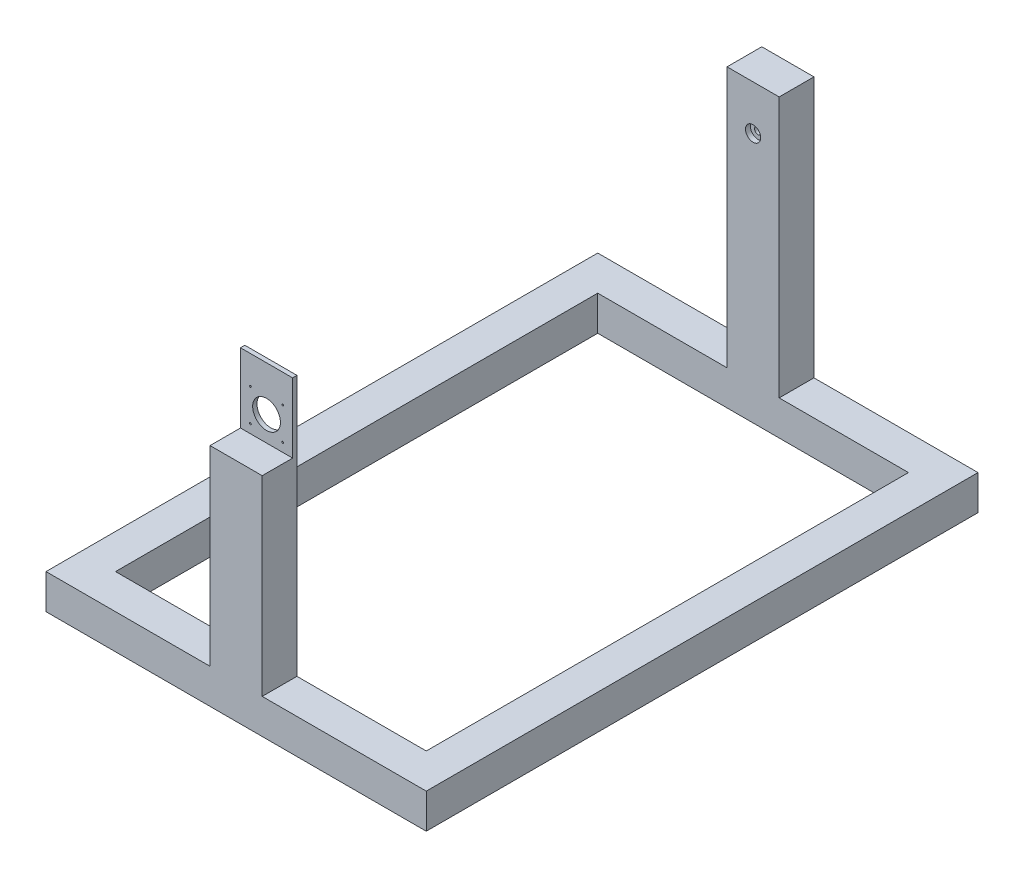
ISO-10303-21;
HEADER;
FILE_DESCRIPTION(('STEP AP214'),'2;1');
FILE_NAME('part.step','',(''),(''),'','','');
FILE_SCHEMA(('AUTOMOTIVE_DESIGN { 1 0 10303 214 1 1 1 1 }'));
ENDSEC;
DATA;
#1=APPLICATION_CONTEXT('core data for automotive mechanical design processes');
#2=APPLICATION_PROTOCOL_DEFINITION('international standard','automotive_design',2000,#1);
#3=PRODUCT_CONTEXT('',#1,'mechanical');
#4=PRODUCT('Part','Part','',(#3));
#5=PRODUCT_RELATED_PRODUCT_CATEGORY('part','',(#4));
#6=PRODUCT_DEFINITION_FORMATION('','',#4);
#7=PRODUCT_DEFINITION_CONTEXT('part definition',#1,'design');
#8=PRODUCT_DEFINITION('design','',#6,#7);
#9=PRODUCT_DEFINITION_SHAPE('','',#8);
#10=(LENGTH_UNIT() NAMED_UNIT(*) SI_UNIT(.MILLI.,.METRE.));
#11=(NAMED_UNIT(*) PLANE_ANGLE_UNIT() SI_UNIT($,.RADIAN.));
#12=(NAMED_UNIT(*) SI_UNIT($,.STERADIAN.) SOLID_ANGLE_UNIT());
#13=UNCERTAINTY_MEASURE_WITH_UNIT(LENGTH_MEASURE(1.E-05),#10,'distance_accuracy_value','');
#14=(GEOMETRIC_REPRESENTATION_CONTEXT(3) GLOBAL_UNCERTAINTY_ASSIGNED_CONTEXT((#13)) GLOBAL_UNIT_ASSIGNED_CONTEXT((#10,
#11,#12)) REPRESENTATION_CONTEXT('',''));
#15=CARTESIAN_POINT('',(0.,0.,0.));
#16=DIRECTION('',(0.,0.,1.));
#17=DIRECTION('',(1.,0.,0.));
#18=AXIS2_PLACEMENT_3D('',#15,#16,#17);
#19=CARTESIAN_POINT('',(0.,50.8,0.));
#20=DIRECTION('',(0.,1.,0.));
#21=DIRECTION('',(0.,0.,1.));
#22=AXIS2_PLACEMENT_3D('',#19,#20,#21);
#23=PLANE('',#22);
#24=DIRECTION('',(-1.,0.,0.));
#25=VECTOR('',#24,1.);
#26=CARTESIAN_POINT('',(-227.099999952,50.8,25.4));
#27=LINE('',#26,#25);
#28=CARTESIAN_POINT('',(-38.1000000000001,50.8,25.4));
#29=VERTEX_POINT('',#28);
#30=CARTESIAN_POINT('',(-227.099999952,50.8,25.4));
#31=VERTEX_POINT('',#30);
#32=EDGE_CURVE('E246',#29,#31,#27,.T.);
#33=ORIENTED_EDGE('',*,*,#32,.F.);
#34=DIRECTION('',(0.,0.,1.));
#35=VECTOR('',#34,1.);
#36=CARTESIAN_POINT('',(-38.1,50.8,-25.4));
#37=LINE('',#36,#35);
#38=CARTESIAN_POINT('',(-38.1,50.8,-25.4));
#39=VERTEX_POINT('',#38);
#40=EDGE_CURVE('E61',#39,#29,#37,.T.);
#41=ORIENTED_EDGE('',*,*,#40,.F.);
#42=DIRECTION('',(-1.,0.,0.));
#43=VECTOR('',#42,1.);
#44=CARTESIAN_POINT('',(-277.899999952,50.8,-25.4));
#45=LINE('',#44,#43);
#46=CARTESIAN_POINT('',(-277.899999952,50.8,-25.4));
#47=VERTEX_POINT('',#46);
#48=EDGE_CURVE('E279',#39,#47,#45,.T.);
#49=ORIENTED_EDGE('',*,*,#48,.T.);
#50=DIRECTION('',(0.,0.,1.));
#51=VECTOR('',#50,1.);
#52=CARTESIAN_POINT('',(-277.899999952,50.8,-25.4));
#53=LINE('',#52,#51);
#54=CARTESIAN_POINT('',(-277.899999952,50.8,781.048240034));
#55=VERTEX_POINT('',#54);
#56=EDGE_CURVE('E271',#47,#55,#53,.T.);
#57=ORIENTED_EDGE('',*,*,#56,.T.);
#58=DIRECTION('',(1.,0.,0.));
#59=VECTOR('',#58,1.);
#60=CARTESIAN_POINT('',(-277.899999952,50.8,781.048240034));
#61=LINE('',#60,#59);
#62=CARTESIAN_POINT('',(-38.1,50.8,781.048240034001));
#63=VERTEX_POINT('',#62);
#64=EDGE_CURVE('E275',#55,#63,#61,.T.);
#65=ORIENTED_EDGE('',*,*,#64,.T.);
#66=DIRECTION('',(0.,0.,1.));
#67=VECTOR('',#66,1.);
#68=CARTESIAN_POINT('',(-38.1,50.8,730.248240034));
#69=LINE('',#68,#67);
#70=CARTESIAN_POINT('',(-38.1,50.8,730.248240034));
#71=VERTEX_POINT('',#70);
#72=EDGE_CURVE('E214',#71,#63,#69,.T.);
#73=ORIENTED_EDGE('',*,*,#72,.F.);
#74=DIRECTION('',(1.,0.,0.));
#75=VECTOR('',#74,1.);
#76=CARTESIAN_POINT('',(227.099999952,50.8,730.248240034));
#77=LINE('',#76,#75);
#78=CARTESIAN_POINT('',(-227.099999952,50.8,730.248240034));
#79=VERTEX_POINT('',#78);
#80=EDGE_CURVE('E240',#79,#71,#77,.T.);
#81=ORIENTED_EDGE('',*,*,#80,.F.);
#82=DIRECTION('',(0.,0.,1.));
#83=VECTOR('',#82,1.);
#84=CARTESIAN_POINT('',(-227.099999952,50.8,25.4));
#85=LINE('',#84,#83);
#86=EDGE_CURVE('E236',#31,#79,#85,.T.);
#87=ORIENTED_EDGE('',*,*,#86,.F.);
#88=EDGE_LOOP('',(#33,#41,#49,#57,#65,#73,#81,#87));
#89=FACE_BOUND('',#88,.T.);
#90=ADVANCED_FACE('F37',(#89),#23,.T.);
#91=CARTESIAN_POINT('',(277.899999952,50.8,-25.4));
#92=VERTEX_POINT('',#91);
#93=CARTESIAN_POINT('',(38.1,50.8,-25.4));
#94=VERTEX_POINT('',#93);
#95=EDGE_CURVE('E280',#92,#94,#45,.T.);
#96=ORIENTED_EDGE('',*,*,#95,.T.);
#97=DIRECTION('',(0.,0.,-1.));
#98=VECTOR('',#97,1.);
#99=CARTESIAN_POINT('',(38.1,50.8,-25.4));
#100=LINE('',#99,#98);
#101=CARTESIAN_POINT('',(38.1,50.8,25.4));
#102=VERTEX_POINT('',#101);
#103=EDGE_CURVE('E190',#102,#94,#100,.T.);
#104=ORIENTED_EDGE('',*,*,#103,.F.);
#105=CARTESIAN_POINT('',(227.099999952,50.8,25.4));
#106=VERTEX_POINT('',#105);
#107=EDGE_CURVE('E247',#106,#102,#27,.T.);
#108=ORIENTED_EDGE('',*,*,#107,.F.);
#109=DIRECTION('',(0.,0.,-1.));
#110=VECTOR('',#109,1.);
#111=CARTESIAN_POINT('',(227.099999952,50.8,25.4));
#112=LINE('',#111,#110);
#113=CARTESIAN_POINT('',(227.099999952,50.8,730.248240034));
#114=VERTEX_POINT('',#113);
#115=EDGE_CURVE('E243',#114,#106,#112,.T.);
#116=ORIENTED_EDGE('',*,*,#115,.F.);
#117=CARTESIAN_POINT('',(38.1,50.8,730.248240034));
#118=VERTEX_POINT('',#117);
#119=EDGE_CURVE('E238',#118,#114,#77,.T.);
#120=ORIENTED_EDGE('',*,*,#119,.F.);
#121=DIRECTION('',(0.,0.,-1.));
#122=VECTOR('',#121,1.);
#123=CARTESIAN_POINT('',(38.1,50.8,730.248240034));
#124=LINE('',#123,#122);
#125=CARTESIAN_POINT('',(38.1,50.8,781.048240034001));
#126=VERTEX_POINT('',#125);
#127=EDGE_CURVE('E217',#126,#118,#124,.T.);
#128=ORIENTED_EDGE('',*,*,#127,.F.);
#129=CARTESIAN_POINT('',(277.899999952,50.8,781.048240034));
#130=VERTEX_POINT('',#129);
#131=EDGE_CURVE('E273',#126,#130,#61,.T.);
#132=ORIENTED_EDGE('',*,*,#131,.T.);
#133=DIRECTION('',(0.,0.,-1.));
#134=VECTOR('',#133,1.);
#135=CARTESIAN_POINT('',(277.899999952,50.8,25.4));
#136=LINE('',#135,#134);
#137=EDGE_CURVE('E277',#130,#92,#136,.T.);
#138=ORIENTED_EDGE('',*,*,#137,.T.);
#139=EDGE_LOOP('',(#96,#104,#108,#116,#120,#128,#132,#138));
#140=FACE_BOUND('',#139,.T.);
#141=ADVANCED_FACE('F326',(#140),#23,.T.);
#142=CARTESIAN_POINT('',(0.,0.,0.));
#143=DIRECTION('',(0.,1.,0.));
#144=DIRECTION('',(0.,0.,1.));
#145=AXIS2_PLACEMENT_3D('',#142,#143,#144);
#146=PLANE('',#145);
#147=DIRECTION('',(0.,0.,1.));
#148=VECTOR('',#147,1.);
#149=CARTESIAN_POINT('',(-277.899999952,0.,25.4));
#150=LINE('',#149,#148);
#151=CARTESIAN_POINT('',(-277.899999952,0.,-25.4));
#152=VERTEX_POINT('',#151);
#153=CARTESIAN_POINT('',(-277.899999952,0.,781.048240034));
#154=VERTEX_POINT('',#153);
#155=EDGE_CURVE('E270',#152,#154,#150,.T.);
#156=ORIENTED_EDGE('',*,*,#155,.F.);
#157=DIRECTION('',(-1.,0.,0.));
#158=VECTOR('',#157,1.);
#159=CARTESIAN_POINT('',(-277.899999952,0.,-25.4));
#160=LINE('',#159,#158);
#161=CARTESIAN_POINT('',(277.899999952,0.,-25.4));
#162=VERTEX_POINT('',#161);
#163=EDGE_CURVE('E274',#162,#152,#160,.T.);
#164=ORIENTED_EDGE('',*,*,#163,.F.);
#165=DIRECTION('',(0.,0.,-1.));
#166=VECTOR('',#165,1.);
#167=CARTESIAN_POINT('',(277.899999952,0.,-25.4));
#168=LINE('',#167,#166);
#169=CARTESIAN_POINT('',(277.899999952,0.,781.048240034));
#170=VERTEX_POINT('',#169);
#171=EDGE_CURVE('E289',#170,#162,#168,.T.);
#172=ORIENTED_EDGE('',*,*,#171,.F.);
#173=DIRECTION('',(1.,0.,0.));
#174=VECTOR('',#173,1.);
#175=CARTESIAN_POINT('',(277.899999952,0.,781.048240034));
#176=LINE('',#175,#174);
#177=EDGE_CURVE('E286',#154,#170,#176,.T.);
#178=ORIENTED_EDGE('',*,*,#177,.F.);
#179=EDGE_LOOP('',(#156,#164,#172,#178));
#180=FACE_BOUND('',#179,.T.);
#181=DIRECTION('',(0.,0.,1.));
#182=VECTOR('',#181,1.);
#183=CARTESIAN_POINT('',(-227.099999952,0.,25.4));
#184=LINE('',#183,#182);
#185=CARTESIAN_POINT('',(-227.099999952,0.,25.4));
#186=VERTEX_POINT('',#185);
#187=CARTESIAN_POINT('',(-227.099999952,0.,730.248240034));
#188=VERTEX_POINT('',#187);
#189=EDGE_CURVE('E235',#186,#188,#184,.T.);
#190=ORIENTED_EDGE('',*,*,#189,.T.);
#191=DIRECTION('',(1.,0.,0.));
#192=VECTOR('',#191,1.);
#193=CARTESIAN_POINT('',(227.099999952,0.,730.248240034));
#194=LINE('',#193,#192);
#195=CARTESIAN_POINT('',(227.099999952,0.,730.248240034));
#196=VERTEX_POINT('',#195);
#197=EDGE_CURVE('E253',#188,#196,#194,.T.);
#198=ORIENTED_EDGE('',*,*,#197,.T.);
#199=DIRECTION('',(0.,0.,-1.));
#200=VECTOR('',#199,1.);
#201=CARTESIAN_POINT('',(227.099999952,0.,25.4));
#202=LINE('',#201,#200);
#203=CARTESIAN_POINT('',(227.099999952,0.,25.4));
#204=VERTEX_POINT('',#203);
#205=EDGE_CURVE('E256',#196,#204,#202,.T.);
#206=ORIENTED_EDGE('',*,*,#205,.T.);
#207=DIRECTION('',(-1.,0.,0.));
#208=VECTOR('',#207,1.);
#209=CARTESIAN_POINT('',(-227.099999952,0.,25.4));
#210=LINE('',#209,#208);
#211=EDGE_CURVE('E239',#204,#186,#210,.T.);
#212=ORIENTED_EDGE('',*,*,#211,.T.);
#213=EDGE_LOOP('',(#190,#198,#206,#212));
#214=FACE_BOUND('',#213,.T.);
#215=ADVANCED_FACE('F311',(#180,#214),#146,.F.);
#216=CARTESIAN_POINT('',(-277.899999952,50.8,25.4));
#217=DIRECTION('',(1.,0.,0.));
#218=DIRECTION('',(0.,0.,-1.));
#219=AXIS2_PLACEMENT_3D('',#216,#217,#218);
#220=PLANE('',#219);
#221=ORIENTED_EDGE('',*,*,#155,.T.);
#222=DIRECTION('',(0.,-1.,0.));
#223=VECTOR('',#222,1.);
#224=CARTESIAN_POINT('',(-277.899999952,50.8,781.048240034));
#225=LINE('',#224,#223);
#226=EDGE_CURVE('E11',#55,#154,#225,.T.);
#227=ORIENTED_EDGE('',*,*,#226,.F.);
#228=ORIENTED_EDGE('',*,*,#56,.F.);
#229=DIRECTION('',(0.,-1.,0.));
#230=VECTOR('',#229,1.);
#231=CARTESIAN_POINT('',(-277.899999952,50.8,-25.4));
#232=LINE('',#231,#230);
#233=EDGE_CURVE('E283',#47,#152,#232,.T.);
#234=ORIENTED_EDGE('',*,*,#233,.T.);
#235=EDGE_LOOP('',(#221,#227,#228,#234));
#236=FACE_BOUND('',#235,.T.);
#237=ADVANCED_FACE('F39',(#236),#220,.F.);
#238=CARTESIAN_POINT('',(277.899999952,50.8,781.048240034));
#239=DIRECTION('',(0.,0.,-1.));
#240=DIRECTION('',(-1.,0.,0.));
#241=AXIS2_PLACEMENT_3D('',#238,#239,#240);
#242=PLANE('',#241);
#243=ORIENTED_EDGE('',*,*,#177,.T.);
#244=DIRECTION('',(0.,-1.,0.));
#245=VECTOR('',#244,1.);
#246=CARTESIAN_POINT('',(277.899999952,50.8,781.048240034));
#247=LINE('',#246,#245);
#248=EDGE_CURVE('E46',#130,#170,#247,.T.);
#249=ORIENTED_EDGE('',*,*,#248,.F.);
#250=ORIENTED_EDGE('',*,*,#131,.F.);
#251=DIRECTION('',(0.,-1.,0.));
#252=VECTOR('',#251,1.);
#253=CARTESIAN_POINT('',(38.1,330.2,781.048240034));
#254=LINE('',#253,#252);
#255=CARTESIAN_POINT('',(38.1,330.2,781.048240034));
#256=VERTEX_POINT('',#255);
#257=EDGE_CURVE('E229',#256,#126,#254,.T.);
#258=ORIENTED_EDGE('',*,*,#257,.F.);
#259=DIRECTION('',(1.,0.,0.));
#260=VECTOR('',#259,1.);
#261=CARTESIAN_POINT('',(-38.1,330.2,781.048240034));
#262=LINE('',#261,#260);
#263=CARTESIAN_POINT('',(-38.1,330.2,781.048240034));
#264=VERTEX_POINT('',#263);
#265=EDGE_CURVE('E216',#264,#256,#262,.T.);
#266=ORIENTED_EDGE('',*,*,#265,.F.);
#267=DIRECTION('',(0.,-1.,0.));
#268=VECTOR('',#267,1.);
#269=CARTESIAN_POINT('',(-38.1,330.2,781.048240034));
#270=LINE('',#269,#268);
#271=EDGE_CURVE('E232',#264,#63,#270,.T.);
#272=ORIENTED_EDGE('',*,*,#271,.T.);
#273=ORIENTED_EDGE('',*,*,#64,.F.);
#274=ORIENTED_EDGE('',*,*,#226,.T.);
#275=EDGE_LOOP('',(#243,#249,#250,#258,#266,#272,#273,#274));
#276=FACE_BOUND('',#275,.T.);
#277=ADVANCED_FACE('F306',(#276),#242,.F.);
#278=CARTESIAN_POINT('',(277.899999952,50.8,-25.4));
#279=DIRECTION('',(-1.,0.,0.));
#280=DIRECTION('',(0.,0.,1.));
#281=AXIS2_PLACEMENT_3D('',#278,#279,#280);
#282=PLANE('',#281);
#283=ORIENTED_EDGE('',*,*,#171,.T.);
#284=DIRECTION('',(0.,-1.,0.));
#285=VECTOR('',#284,1.);
#286=CARTESIAN_POINT('',(277.899999952,50.8,-25.4));
#287=LINE('',#286,#285);
#288=EDGE_CURVE('E295',#92,#162,#287,.T.);
#289=ORIENTED_EDGE('',*,*,#288,.F.);
#290=ORIENTED_EDGE('',*,*,#137,.F.);
#291=ORIENTED_EDGE('',*,*,#248,.T.);
#292=EDGE_LOOP('',(#283,#289,#290,#291));
#293=FACE_BOUND('',#292,.T.);
#294=ADVANCED_FACE('F302',(#293),#282,.F.);
#295=CARTESIAN_POINT('',(-277.899999952,50.8,-25.4));
#296=DIRECTION('',(0.,0.,1.));
#297=DIRECTION('',(1.,0.,0.));
#298=AXIS2_PLACEMENT_3D('',#295,#296,#297);
#299=PLANE('',#298);
#300=CARTESIAN_POINT('',(0.,366.47317231,-25.4));
#301=DIRECTION('',(0.,0.,1.));
#302=DIRECTION('',(1.,0.,0.));
#303=AXIS2_PLACEMENT_3D('',#300,#301,#302);
#304=CIRCLE('',#303,5.08000000000001);
#305=CARTESIAN_POINT('',(5.07999999999997,366.47317231,-25.4));
#306=VERTEX_POINT('',#305);
#307=EDGE_CURVE('E41',#306,#306,#304,.T.);
#308=ORIENTED_EDGE('',*,*,#307,.T.);
#309=EDGE_LOOP('',(#308));
#310=FACE_BOUND('',#309,.T.);
#311=ORIENTED_EDGE('',*,*,#163,.T.);
#312=ORIENTED_EDGE('',*,*,#233,.F.);
#313=ORIENTED_EDGE('',*,*,#48,.F.);
#314=DIRECTION('',(0.,-1.,0.));
#315=VECTOR('',#314,1.);
#316=CARTESIAN_POINT('',(-38.1,431.8,-25.4));
#317=LINE('',#316,#315);
#318=CARTESIAN_POINT('',(-38.1,431.8,-25.4));
#319=VERTEX_POINT('',#318);
#320=EDGE_CURVE('E203',#319,#39,#317,.T.);
#321=ORIENTED_EDGE('',*,*,#320,.F.);
#322=DIRECTION('',(-1.,0.,0.));
#323=VECTOR('',#322,1.);
#324=CARTESIAN_POINT('',(-38.1,431.8,-25.4));
#325=LINE('',#324,#323);
#326=CARTESIAN_POINT('',(38.1,431.8,-25.4));
#327=VERTEX_POINT('',#326);
#328=EDGE_CURVE('E202',#327,#319,#325,.T.);
#329=ORIENTED_EDGE('',*,*,#328,.F.);
#330=DIRECTION('',(0.,-1.,0.));
#331=VECTOR('',#330,1.);
#332=CARTESIAN_POINT('',(38.1,431.8,-25.4));
#333=LINE('',#332,#331);
#334=EDGE_CURVE('E207',#327,#94,#333,.T.);
#335=ORIENTED_EDGE('',*,*,#334,.T.);
#336=ORIENTED_EDGE('',*,*,#95,.F.);
#337=ORIENTED_EDGE('',*,*,#288,.T.);
#338=EDGE_LOOP('',(#311,#312,#313,#321,#329,#335,#336,#337));
#339=FACE_BOUND('',#338,.T.);
#340=ADVANCED_FACE('F319',(#310,#339),#299,.F.);
#341=CARTESIAN_POINT('',(-227.099999952,50.8,25.4));
#342=DIRECTION('',(1.,0.,0.));
#343=DIRECTION('',(0.,0.,-1.));
#344=AXIS2_PLACEMENT_3D('',#341,#342,#343);
#345=PLANE('',#344);
#346=ORIENTED_EDGE('',*,*,#189,.F.);
#347=DIRECTION('',(0.,-1.,0.));
#348=VECTOR('',#347,1.);
#349=CARTESIAN_POINT('',(-227.099999952,50.8,25.4));
#350=LINE('',#349,#348);
#351=EDGE_CURVE('E250',#31,#186,#350,.T.);
#352=ORIENTED_EDGE('',*,*,#351,.F.);
#353=ORIENTED_EDGE('',*,*,#86,.T.);
#354=DIRECTION('',(0.,-1.,0.));
#355=VECTOR('',#354,1.);
#356=CARTESIAN_POINT('',(-227.099999952,50.8,730.248240034));
#357=LINE('',#356,#355);
#358=EDGE_CURVE('E267',#79,#188,#357,.T.);
#359=ORIENTED_EDGE('',*,*,#358,.T.);
#360=EDGE_LOOP('',(#346,#352,#353,#359));
#361=FACE_BOUND('',#360,.T.);
#362=ADVANCED_FACE('F403',(#361),#345,.T.);
#363=CARTESIAN_POINT('',(227.099999952,50.8,730.248240034));
#364=DIRECTION('',(0.,0.,-1.));
#365=DIRECTION('',(-1.,0.,0.));
#366=AXIS2_PLACEMENT_3D('',#363,#364,#365);
#367=PLANE('',#366);
#368=CARTESIAN_POINT('',(23.57317231,390.04634462,730.248240034));
#369=DIRECTION('',(0.,0.,1.));
#370=DIRECTION('',(1.,0.,0.));
#371=AXIS2_PLACEMENT_3D('',#368,#369,#370);
#372=CIRCLE('',#371,1.26999999999997);
#373=CARTESIAN_POINT('',(24.8431723099999,390.04634462,730.248240034));
#374=VERTEX_POINT('',#373);
#375=EDGE_CURVE('E347',#374,#374,#372,.T.);
#376=ORIENTED_EDGE('',*,*,#375,.T.);
#377=EDGE_LOOP('',(#376));
#378=FACE_BOUND('',#377,.T.);
#379=CARTESIAN_POINT('',(23.57317231,342.9,730.248240034));
#380=DIRECTION('',(0.,0.,1.));
#381=DIRECTION('',(1.,0.,0.));
#382=AXIS2_PLACEMENT_3D('',#379,#380,#381);
#383=CIRCLE('',#382,1.26999999999997);
#384=CARTESIAN_POINT('',(24.8431723099999,342.9,730.248240034));
#385=VERTEX_POINT('',#384);
#386=EDGE_CURVE('E354',#385,#385,#383,.T.);
#387=ORIENTED_EDGE('',*,*,#386,.T.);
#388=EDGE_LOOP('',(#387));
#389=FACE_BOUND('',#388,.T.);
#390=CARTESIAN_POINT('',(-23.57317231,342.9,730.248240034));
#391=DIRECTION('',(0.,0.,1.));
#392=DIRECTION('',(1.,0.,0.));
#393=AXIS2_PLACEMENT_3D('',#390,#391,#392);
#394=CIRCLE('',#393,1.26999999999997);
#395=CARTESIAN_POINT('',(-22.30317231,342.9,730.248240034));
#396=VERTEX_POINT('',#395);
#397=EDGE_CURVE('E360',#396,#396,#394,.T.);
#398=ORIENTED_EDGE('',*,*,#397,.T.);
#399=EDGE_LOOP('',(#398));
#400=FACE_BOUND('',#399,.T.);
#401=CARTESIAN_POINT('',(-23.57317231,390.04634462,730.248240034));
#402=DIRECTION('',(0.,0.,1.));
#403=DIRECTION('',(1.,0.,0.));
#404=AXIS2_PLACEMENT_3D('',#401,#402,#403);
#405=CIRCLE('',#404,1.26999999999997);
#406=CARTESIAN_POINT('',(-22.3031723100001,390.04634462,730.248240034));
#407=VERTEX_POINT('',#406);
#408=EDGE_CURVE('E366',#407,#407,#405,.T.);
#409=ORIENTED_EDGE('',*,*,#408,.T.);
#410=EDGE_LOOP('',(#409));
#411=FACE_BOUND('',#410,.T.);
#412=CARTESIAN_POINT('',(0.,366.47317231,730.248240034));
#413=DIRECTION('',(0.,0.,1.));
#414=DIRECTION('',(1.,0.,0.));
#415=AXIS2_PLACEMENT_3D('',#412,#413,#414);
#416=CIRCLE('',#415,20.32);
#417=CARTESIAN_POINT('',(20.32,366.47317231,730.248240034));
#418=VERTEX_POINT('',#417);
#419=EDGE_CURVE('E337',#418,#418,#416,.T.);
#420=ORIENTED_EDGE('',*,*,#419,.T.);
#421=EDGE_LOOP('',(#420));
#422=FACE_BOUND('',#421,.T.);
#423=ORIENTED_EDGE('',*,*,#197,.F.);
#424=ORIENTED_EDGE('',*,*,#358,.F.);
#425=ORIENTED_EDGE('',*,*,#80,.T.);
#426=DIRECTION('',(0.,-1.,0.));
#427=VECTOR('',#426,1.);
#428=CARTESIAN_POINT('',(-38.1,330.2,730.248240034));
#429=LINE('',#428,#427);
#430=CARTESIAN_POINT('',(-38.1,431.8,730.248240034));
#431=VERTEX_POINT('',#430);
#432=EDGE_CURVE('E221',#431,#71,#429,.T.);
#433=ORIENTED_EDGE('',*,*,#432,.F.);
#434=DIRECTION('',(-1.,0.,0.));
#435=VECTOR('',#434,1.);
#436=CARTESIAN_POINT('',(-38.1,431.8,730.248240034));
#437=LINE('',#436,#435);
#438=CARTESIAN_POINT('',(38.1,431.8,730.248240034));
#439=VERTEX_POINT('',#438);
#440=EDGE_CURVE('E181',#439,#431,#437,.T.);
#441=ORIENTED_EDGE('',*,*,#440,.F.);
#442=DIRECTION('',(0.,-1.,0.));
#443=VECTOR('',#442,1.);
#444=CARTESIAN_POINT('',(38.1,330.2,730.248240034));
#445=LINE('',#444,#443);
#446=EDGE_CURVE('E226',#439,#118,#445,.T.);
#447=ORIENTED_EDGE('',*,*,#446,.T.);
#448=ORIENTED_EDGE('',*,*,#119,.T.);
#449=DIRECTION('',(0.,-1.,0.));
#450=VECTOR('',#449,1.);
#451=CARTESIAN_POINT('',(227.099999952,50.8,730.248240034));
#452=LINE('',#451,#450);
#453=EDGE_CURVE('E265',#114,#196,#452,.T.);
#454=ORIENTED_EDGE('',*,*,#453,.T.);
#455=EDGE_LOOP('',(#423,#424,#425,#433,#441,#447,#448,#454));
#456=FACE_BOUND('',#455,.T.);
#457=ADVANCED_FACE('F333',(#378,#389,#400,#411,#422,#456),#367,.T.);
#458=CARTESIAN_POINT('',(227.099999952,50.8,25.4));
#459=DIRECTION('',(-1.,0.,0.));
#460=DIRECTION('',(0.,0.,1.));
#461=AXIS2_PLACEMENT_3D('',#458,#459,#460);
#462=PLANE('',#461);
#463=ORIENTED_EDGE('',*,*,#205,.F.);
#464=ORIENTED_EDGE('',*,*,#453,.F.);
#465=ORIENTED_EDGE('',*,*,#115,.T.);
#466=DIRECTION('',(0.,-1.,0.));
#467=VECTOR('',#466,1.);
#468=CARTESIAN_POINT('',(227.099999952,50.8,25.4));
#469=LINE('',#468,#467);
#470=EDGE_CURVE('E263',#106,#204,#469,.T.);
#471=ORIENTED_EDGE('',*,*,#470,.T.);
#472=EDGE_LOOP('',(#463,#464,#465,#471));
#473=FACE_BOUND('',#472,.T.);
#474=ADVANCED_FACE('F513',(#473),#462,.T.);
#475=CARTESIAN_POINT('',(-227.099999952,50.8,25.4));
#476=DIRECTION('',(0.,0.,1.));
#477=DIRECTION('',(1.,0.,0.));
#478=AXIS2_PLACEMENT_3D('',#475,#476,#477);
#479=PLANE('',#478);
#480=CARTESIAN_POINT('',(0.,366.47317231,25.4));
#481=DIRECTION('',(0.,0.,1.));
#482=DIRECTION('',(1.,0.,0.));
#483=AXIS2_PLACEMENT_3D('',#480,#481,#482);
#484=CIRCLE('',#483,11.1125);
#485=CARTESIAN_POINT('',(11.1125,366.47317231,25.4));
#486=VERTEX_POINT('',#485);
#487=EDGE_CURVE('E371',#486,#486,#484,.T.);
#488=ORIENTED_EDGE('',*,*,#487,.F.);
#489=EDGE_LOOP('',(#488));
#490=FACE_BOUND('',#489,.T.);
#491=ORIENTED_EDGE('',*,*,#211,.F.);
#492=ORIENTED_EDGE('',*,*,#470,.F.);
#493=ORIENTED_EDGE('',*,*,#107,.T.);
#494=DIRECTION('',(0.,-1.,0.));
#495=VECTOR('',#494,1.);
#496=CARTESIAN_POINT('',(38.1,431.8,25.4));
#497=LINE('',#496,#495);
#498=CARTESIAN_POINT('',(38.1,431.8,25.4));
#499=VERTEX_POINT('',#498);
#500=EDGE_CURVE('E210',#499,#102,#497,.T.);
#501=ORIENTED_EDGE('',*,*,#500,.F.);
#502=DIRECTION('',(1.,0.,0.));
#503=VECTOR('',#502,1.);
#504=CARTESIAN_POINT('',(-38.1,431.8,25.4));
#505=LINE('',#504,#503);
#506=CARTESIAN_POINT('',(-38.1,431.8,25.4));
#507=VERTEX_POINT('',#506);
#508=EDGE_CURVE('E198',#507,#499,#505,.T.);
#509=ORIENTED_EDGE('',*,*,#508,.F.);
#510=DIRECTION('',(0.,-1.,0.));
#511=VECTOR('',#510,1.);
#512=CARTESIAN_POINT('',(-38.1,431.8,25.4));
#513=LINE('',#512,#511);
#514=EDGE_CURVE('E212',#507,#29,#513,.T.);
#515=ORIENTED_EDGE('',*,*,#514,.T.);
#516=ORIENTED_EDGE('',*,*,#32,.T.);
#517=ORIENTED_EDGE('',*,*,#351,.T.);
#518=EDGE_LOOP('',(#491,#492,#493,#501,#509,#515,#516,#517));
#519=FACE_BOUND('',#518,.T.);
#520=ADVANCED_FACE('F474',(#490,#519),#479,.T.);
#521=CARTESIAN_POINT('',(-38.1,330.2,730.248240034));
#522=DIRECTION('',(1.,0.,0.));
#523=DIRECTION('',(0.,0.,-1.));
#524=AXIS2_PLACEMENT_3D('',#521,#522,#523);
#525=PLANE('',#524);
#526=ORIENTED_EDGE('',*,*,#72,.T.);
#527=ORIENTED_EDGE('',*,*,#271,.F.);
#528=DIRECTION('',(0.,0.,1.));
#529=VECTOR('',#528,1.);
#530=CARTESIAN_POINT('',(-38.1,330.2,730.248240034));
#531=LINE('',#530,#529);
#532=CARTESIAN_POINT('',(-38.1,330.2,736.598240034));
#533=VERTEX_POINT('',#532);
#534=EDGE_CURVE('E188',#533,#264,#531,.T.);
#535=ORIENTED_EDGE('',*,*,#534,.F.);
#536=DIRECTION('',(0.,-1.,0.));
#537=VECTOR('',#536,1.);
#538=CARTESIAN_POINT('',(-38.1,431.8,736.598240034));
#539=LINE('',#538,#537);
#540=CARTESIAN_POINT('',(-38.1,431.8,736.598240034));
#541=VERTEX_POINT('',#540);
#542=EDGE_CURVE('E168',#541,#533,#539,.T.);
#543=ORIENTED_EDGE('',*,*,#542,.F.);
#544=DIRECTION('',(0.,0.,1.));
#545=VECTOR('',#544,1.);
#546=CARTESIAN_POINT('',(-38.1,431.8,730.248240034));
#547=LINE('',#546,#545);
#548=EDGE_CURVE('E175',#431,#541,#547,.T.);
#549=ORIENTED_EDGE('',*,*,#548,.F.);
#550=ORIENTED_EDGE('',*,*,#432,.T.);
#551=EDGE_LOOP('',(#526,#527,#535,#543,#549,#550));
#552=FACE_BOUND('',#551,.T.);
#553=ADVANCED_FACE('F186',(#552),#525,.F.);
#554=CARTESIAN_POINT('',(38.1,330.2,730.248240034));
#555=DIRECTION('',(-1.,0.,0.));
#556=DIRECTION('',(0.,0.,1.));
#557=AXIS2_PLACEMENT_3D('',#554,#555,#556);
#558=PLANE('',#557);
#559=ORIENTED_EDGE('',*,*,#127,.T.);
#560=ORIENTED_EDGE('',*,*,#446,.F.);
#561=DIRECTION('',(0.,0.,-1.));
#562=VECTOR('',#561,1.);
#563=CARTESIAN_POINT('',(38.1,431.8,730.248240034));
#564=LINE('',#563,#562);
#565=CARTESIAN_POINT('',(38.1,431.8,736.598240034));
#566=VERTEX_POINT('',#565);
#567=EDGE_CURVE('E174',#566,#439,#564,.T.);
#568=ORIENTED_EDGE('',*,*,#567,.F.);
#569=DIRECTION('',(0.,-1.,0.));
#570=VECTOR('',#569,1.);
#571=CARTESIAN_POINT('',(38.1,431.8,736.598240034));
#572=LINE('',#571,#570);
#573=CARTESIAN_POINT('',(38.1,330.2,736.598240034));
#574=VERTEX_POINT('',#573);
#575=EDGE_CURVE('E170',#566,#574,#572,.T.);
#576=ORIENTED_EDGE('',*,*,#575,.T.);
#577=DIRECTION('',(0.,0.,-1.));
#578=VECTOR('',#577,1.);
#579=CARTESIAN_POINT('',(38.1,330.2,730.248240034));
#580=LINE('',#579,#578);
#581=EDGE_CURVE('E219',#256,#574,#580,.T.);
#582=ORIENTED_EDGE('',*,*,#581,.F.);
#583=ORIENTED_EDGE('',*,*,#257,.T.);
#584=EDGE_LOOP('',(#559,#560,#568,#576,#582,#583));
#585=FACE_BOUND('',#584,.T.);
#586=ADVANCED_FACE('F330',(#585),#558,.F.);
#587=CARTESIAN_POINT('',(0.,330.2,0.));
#588=DIRECTION('',(0.,1.,0.));
#589=DIRECTION('',(0.,0.,1.));
#590=AXIS2_PLACEMENT_3D('',#587,#588,#589);
#591=PLANE('',#590);
#592=DIRECTION('',(1.,0.,0.));
#593=VECTOR('',#592,1.);
#594=CARTESIAN_POINT('',(-38.1,330.2,736.598240034));
#595=LINE('',#594,#593);
#596=EDGE_CURVE('E53',#533,#574,#595,.T.);
#597=ORIENTED_EDGE('',*,*,#596,.F.);
#598=ORIENTED_EDGE('',*,*,#534,.T.);
#599=ORIENTED_EDGE('',*,*,#265,.T.);
#600=ORIENTED_EDGE('',*,*,#581,.T.);
#601=EDGE_LOOP('',(#597,#598,#599,#600));
#602=FACE_BOUND('',#601,.T.);
#603=ADVANCED_FACE('F439',(#602),#591,.T.);
#604=CARTESIAN_POINT('',(-38.1,431.8,-25.4));
#605=DIRECTION('',(1.,0.,0.));
#606=DIRECTION('',(0.,0.,-1.));
#607=AXIS2_PLACEMENT_3D('',#604,#605,#606);
#608=PLANE('',#607);
#609=ORIENTED_EDGE('',*,*,#40,.T.);
#610=ORIENTED_EDGE('',*,*,#514,.F.);
#611=DIRECTION('',(0.,0.,1.));
#612=VECTOR('',#611,1.);
#613=CARTESIAN_POINT('',(-38.1,431.8,-25.4));
#614=LINE('',#613,#612);
#615=EDGE_CURVE('E195',#319,#507,#614,.T.);
#616=ORIENTED_EDGE('',*,*,#615,.F.);
#617=ORIENTED_EDGE('',*,*,#320,.T.);
#618=EDGE_LOOP('',(#609,#610,#616,#617));
#619=FACE_BOUND('',#618,.T.);
#620=ADVANCED_FACE('F433',(#619),#608,.F.);
#621=CARTESIAN_POINT('',(38.1,431.8,-25.4));
#622=DIRECTION('',(-1.,0.,0.));
#623=DIRECTION('',(0.,0.,1.));
#624=AXIS2_PLACEMENT_3D('',#621,#622,#623);
#625=PLANE('',#624);
#626=ORIENTED_EDGE('',*,*,#103,.T.);
#627=ORIENTED_EDGE('',*,*,#334,.F.);
#628=DIRECTION('',(0.,0.,-1.));
#629=VECTOR('',#628,1.);
#630=CARTESIAN_POINT('',(38.1,431.8,-25.4));
#631=LINE('',#630,#629);
#632=EDGE_CURVE('E200',#499,#327,#631,.T.);
#633=ORIENTED_EDGE('',*,*,#632,.F.);
#634=ORIENTED_EDGE('',*,*,#500,.T.);
#635=EDGE_LOOP('',(#626,#627,#633,#634));
#636=FACE_BOUND('',#635,.T.);
#637=ADVANCED_FACE('F438',(#636),#625,.F.);
#638=CARTESIAN_POINT('',(0.,431.8,0.));
#639=DIRECTION('',(0.,1.,0.));
#640=DIRECTION('',(0.,0.,1.));
#641=AXIS2_PLACEMENT_3D('',#638,#639,#640);
#642=PLANE('',#641);
#643=ORIENTED_EDGE('',*,*,#615,.T.);
#644=ORIENTED_EDGE('',*,*,#508,.T.);
#645=ORIENTED_EDGE('',*,*,#632,.T.);
#646=ORIENTED_EDGE('',*,*,#328,.T.);
#647=EDGE_LOOP('',(#643,#644,#645,#646));
#648=FACE_BOUND('',#647,.T.);
#649=ADVANCED_FACE('F451',(#648),#642,.T.);
#650=CARTESIAN_POINT('',(-38.1,431.8,736.598240034));
#651=DIRECTION('',(0.,0.,-1.));
#652=DIRECTION('',(-1.,0.,0.));
#653=AXIS2_PLACEMENT_3D('',#650,#651,#652);
#654=PLANE('',#653);
#655=CARTESIAN_POINT('',(23.57317231,390.04634462,736.598240034));
#656=DIRECTION('',(0.,0.,1.));
#657=DIRECTION('',(1.,0.,0.));
#658=AXIS2_PLACEMENT_3D('',#655,#656,#657);
#659=CIRCLE('',#658,1.26999999999997);
#660=CARTESIAN_POINT('',(24.8431723099999,390.04634462,736.598240034));
#661=VERTEX_POINT('',#660);
#662=EDGE_CURVE('E350',#661,#661,#659,.T.);
#663=ORIENTED_EDGE('',*,*,#662,.F.);
#664=EDGE_LOOP('',(#663));
#665=FACE_BOUND('',#664,.T.);
#666=CARTESIAN_POINT('',(23.57317231,342.9,736.598240034));
#667=DIRECTION('',(0.,0.,1.));
#668=DIRECTION('',(1.,0.,0.));
#669=AXIS2_PLACEMENT_3D('',#666,#667,#668);
#670=CIRCLE('',#669,1.26999999999997);
#671=CARTESIAN_POINT('',(24.8431723099999,342.9,736.598240034));
#672=VERTEX_POINT('',#671);
#673=EDGE_CURVE('E357',#672,#672,#670,.T.);
#674=ORIENTED_EDGE('',*,*,#673,.F.);
#675=EDGE_LOOP('',(#674));
#676=FACE_BOUND('',#675,.T.);
#677=CARTESIAN_POINT('',(-23.57317231,342.9,736.598240034));
#678=DIRECTION('',(0.,0.,1.));
#679=DIRECTION('',(1.,0.,0.));
#680=AXIS2_PLACEMENT_3D('',#677,#678,#679);
#681=CIRCLE('',#680,1.26999999999997);
#682=CARTESIAN_POINT('',(-22.30317231,342.9,736.598240034));
#683=VERTEX_POINT('',#682);
#684=EDGE_CURVE('E363',#683,#683,#681,.T.);
#685=ORIENTED_EDGE('',*,*,#684,.F.);
#686=EDGE_LOOP('',(#685));
#687=FACE_BOUND('',#686,.T.);
#688=CARTESIAN_POINT('',(-23.57317231,390.04634462,736.598240034));
#689=DIRECTION('',(0.,0.,1.));
#690=DIRECTION('',(1.,0.,0.));
#691=AXIS2_PLACEMENT_3D('',#688,#689,#690);
#692=CIRCLE('',#691,1.26999999999997);
#693=CARTESIAN_POINT('',(-22.3031723100001,390.04634462,736.598240034));
#694=VERTEX_POINT('',#693);
#695=EDGE_CURVE('E344',#694,#694,#692,.T.);
#696=ORIENTED_EDGE('',*,*,#695,.F.);
#697=EDGE_LOOP('',(#696));
#698=FACE_BOUND('',#697,.T.);
#699=CARTESIAN_POINT('',(0.,366.47317231,736.598240034));
#700=DIRECTION('',(0.,0.,1.));
#701=DIRECTION('',(1.,0.,0.));
#702=AXIS2_PLACEMENT_3D('',#699,#700,#701);
#703=CIRCLE('',#702,20.32);
#704=CARTESIAN_POINT('',(20.32,366.47317231,736.598240034));
#705=VERTEX_POINT('',#704);
#706=EDGE_CURVE('E339',#705,#705,#703,.T.);
#707=ORIENTED_EDGE('',*,*,#706,.F.);
#708=EDGE_LOOP('',(#707));
#709=FACE_BOUND('',#708,.T.);
#710=ORIENTED_EDGE('',*,*,#596,.T.);
#711=ORIENTED_EDGE('',*,*,#575,.F.);
#712=DIRECTION('',(1.,0.,0.));
#713=VECTOR('',#712,1.);
#714=CARTESIAN_POINT('',(-38.1,431.8,736.598240034));
#715=LINE('',#714,#713);
#716=EDGE_CURVE('E164',#541,#566,#715,.T.);
#717=ORIENTED_EDGE('',*,*,#716,.F.);
#718=ORIENTED_EDGE('',*,*,#542,.T.);
#719=EDGE_LOOP('',(#710,#711,#717,#718));
#720=FACE_BOUND('',#719,.T.);
#721=ADVANCED_FACE('F166',(#665,#676,#687,#698,#709,#720),#654,.F.);
#722=CARTESIAN_POINT('',(0.,431.8,0.));
#723=DIRECTION('',(0.,1.,0.));
#724=DIRECTION('',(0.,0.,1.));
#725=AXIS2_PLACEMENT_3D('',#722,#723,#724);
#726=PLANE('',#725);
#727=ORIENTED_EDGE('',*,*,#548,.T.);
#728=ORIENTED_EDGE('',*,*,#716,.T.);
#729=ORIENTED_EDGE('',*,*,#567,.T.);
#730=ORIENTED_EDGE('',*,*,#440,.T.);
#731=EDGE_LOOP('',(#727,#728,#729,#730));
#732=FACE_BOUND('',#731,.T.);
#733=ADVANCED_FACE('F179',(#732),#726,.T.);
#734=CARTESIAN_POINT('',(0.,366.47317231,730.248240034));
#735=DIRECTION('',(0.,0.,1.));
#736=DIRECTION('',(1.,0.,0.));
#737=AXIS2_PLACEMENT_3D('',#734,#735,#736);
#738=CYLINDRICAL_SURFACE('',#737,20.32);
#739=ORIENTED_EDGE('',*,*,#419,.F.);
#740=EDGE_LOOP('',(#739));
#741=FACE_BOUND('',#740,.T.);
#742=ORIENTED_EDGE('',*,*,#706,.T.);
#743=EDGE_LOOP('',(#742));
#744=FACE_BOUND('',#743,.T.);
#745=ADVANCED_FACE('F502',(#741,#744),#738,.F.);
#746=CARTESIAN_POINT('',(-23.57317231,390.04634462,730.248240034));
#747=DIRECTION('',(0.,0.,1.));
#748=DIRECTION('',(1.,0.,0.));
#749=AXIS2_PLACEMENT_3D('',#746,#747,#748);
#750=CYLINDRICAL_SURFACE('',#749,1.26999999999997);
#751=ORIENTED_EDGE('',*,*,#408,.F.);
#752=EDGE_LOOP('',(#751));
#753=FACE_BOUND('',#752,.T.);
#754=ORIENTED_EDGE('',*,*,#695,.T.);
#755=EDGE_LOOP('',(#754));
#756=FACE_BOUND('',#755,.T.);
#757=ADVANCED_FACE('F531',(#753,#756),#750,.F.);
#758=CARTESIAN_POINT('',(-23.57317231,342.9,730.248240034));
#759=DIRECTION('',(0.,0.,1.));
#760=DIRECTION('',(1.,0.,0.));
#761=AXIS2_PLACEMENT_3D('',#758,#759,#760);
#762=CYLINDRICAL_SURFACE('',#761,1.26999999999997);
#763=ORIENTED_EDGE('',*,*,#397,.F.);
#764=EDGE_LOOP('',(#763));
#765=FACE_BOUND('',#764,.T.);
#766=ORIENTED_EDGE('',*,*,#684,.T.);
#767=EDGE_LOOP('',(#766));
#768=FACE_BOUND('',#767,.T.);
#769=ADVANCED_FACE('F542',(#765,#768),#762,.F.);
#770=CARTESIAN_POINT('',(23.57317231,342.9,730.248240034));
#771=DIRECTION('',(0.,0.,1.));
#772=DIRECTION('',(1.,0.,0.));
#773=AXIS2_PLACEMENT_3D('',#770,#771,#772);
#774=CYLINDRICAL_SURFACE('',#773,1.26999999999997);
#775=ORIENTED_EDGE('',*,*,#386,.F.);
#776=EDGE_LOOP('',(#775));
#777=FACE_BOUND('',#776,.T.);
#778=ORIENTED_EDGE('',*,*,#673,.T.);
#779=EDGE_LOOP('',(#778));
#780=FACE_BOUND('',#779,.T.);
#781=ADVANCED_FACE('F553',(#777,#780),#774,.F.);
#782=CARTESIAN_POINT('',(23.57317231,390.04634462,730.248240034));
#783=DIRECTION('',(0.,0.,1.));
#784=DIRECTION('',(1.,0.,0.));
#785=AXIS2_PLACEMENT_3D('',#782,#783,#784);
#786=CYLINDRICAL_SURFACE('',#785,1.26999999999997);
#787=ORIENTED_EDGE('',*,*,#375,.F.);
#788=EDGE_LOOP('',(#787));
#789=FACE_BOUND('',#788,.T.);
#790=ORIENTED_EDGE('',*,*,#662,.T.);
#791=EDGE_LOOP('',(#790));
#792=FACE_BOUND('',#791,.T.);
#793=ADVANCED_FACE('F564',(#789,#792),#786,.F.);
#794=CARTESIAN_POINT('',(0.,366.47317231,18.25625));
#795=DIRECTION('',(0.,0.,1.));
#796=DIRECTION('',(1.,0.,0.));
#797=AXIS2_PLACEMENT_3D('',#794,#795,#796);
#798=CYLINDRICAL_SURFACE('',#797,11.1125);
#799=CARTESIAN_POINT('',(0.,366.47317231,18.25625));
#800=DIRECTION('',(0.,0.,1.));
#801=DIRECTION('',(1.,0.,0.));
#802=AXIS2_PLACEMENT_3D('',#799,#800,#801);
#803=CIRCLE('',#802,11.1125);
#804=CARTESIAN_POINT('',(11.1125,366.47317231,18.25625));
#805=VERTEX_POINT('',#804);
#806=EDGE_CURVE('E351',#805,#805,#803,.T.);
#807=ORIENTED_EDGE('',*,*,#806,.F.);
#808=EDGE_LOOP('',(#807));
#809=FACE_BOUND('',#808,.T.);
#810=ORIENTED_EDGE('',*,*,#487,.T.);
#811=EDGE_LOOP('',(#810));
#812=FACE_BOUND('',#811,.T.);
#813=ADVANCED_FACE('F391',(#809,#812),#798,.F.);
#814=CARTESIAN_POINT('',(0.,366.47317231,18.25625));
#815=DIRECTION('',(0.,0.,1.));
#816=DIRECTION('',(1.,0.,0.));
#817=AXIS2_PLACEMENT_3D('',#814,#815,#816);
#818=PLANE('',#817);
#819=CARTESIAN_POINT('',(0.,366.47317231,18.25625));
#820=DIRECTION('',(0.,0.,1.));
#821=DIRECTION('',(1.,0.,0.));
#822=AXIS2_PLACEMENT_3D('',#819,#820,#821);
#823=CIRCLE('',#822,5.08000000000001);
#824=CARTESIAN_POINT('',(5.07999999999997,366.47317231,18.25625));
#825=VERTEX_POINT('',#824);
#826=EDGE_CURVE('E376',#825,#825,#823,.T.);
#827=ORIENTED_EDGE('',*,*,#826,.F.);
#828=EDGE_LOOP('',(#827));
#829=FACE_BOUND('',#828,.T.);
#830=ORIENTED_EDGE('',*,*,#806,.T.);
#831=EDGE_LOOP('',(#830));
#832=FACE_BOUND('',#831,.T.);
#833=ADVANCED_FACE('F386',(#829,#832),#818,.T.);
#834=CARTESIAN_POINT('',(0.,366.47317231,-32.54375));
#835=DIRECTION('',(0.,0.,1.));
#836=DIRECTION('',(1.,0.,0.));
#837=AXIS2_PLACEMENT_3D('',#834,#835,#836);
#838=CYLINDRICAL_SURFACE('',#837,5.08000000000001);
#839=ORIENTED_EDGE('',*,*,#826,.T.);
#840=EDGE_LOOP('',(#839));
#841=FACE_BOUND('',#840,.T.);
#842=ORIENTED_EDGE('',*,*,#307,.F.);
#843=EDGE_LOOP('',(#842));
#844=FACE_BOUND('',#843,.T.);
#845=ADVANCED_FACE('F384',(#841,#844),#838,.F.);
#846=CLOSED_SHELL('',(#90,#141,#215,#237,#277,#294,#340,#362,#457,#474,#520,#553,#586,#603,#620,
#637,#649,#721,#733,#745,#757,#769,#781,#793,#813,#833,#845));
#847=MANIFOLD_SOLID_BREP('B2',#846);
#848=ADVANCED_BREP_SHAPE_REPRESENTATION('',(#18,#847),#14);
#849=SHAPE_DEFINITION_REPRESENTATION(#9,#848);
ENDSEC;
END-ISO-10303-21;
